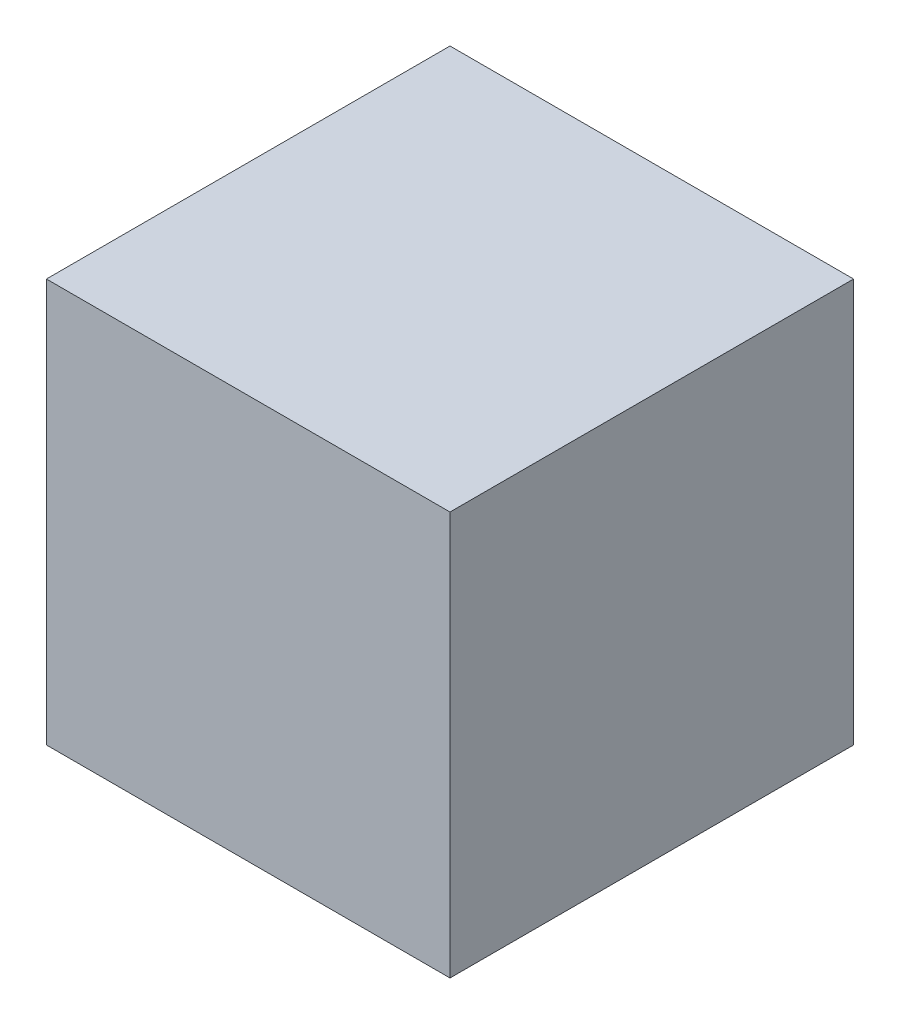
ISO-10303-21;
HEADER;
FILE_DESCRIPTION(('STEP AP214'),'2;1');
FILE_NAME('part.step','',(''),(''),'','','');
FILE_SCHEMA(('AUTOMOTIVE_DESIGN { 1 0 10303 214 1 1 1 1 }'));
ENDSEC;
DATA;
#1=APPLICATION_CONTEXT('core data for automotive mechanical design processes');
#2=APPLICATION_PROTOCOL_DEFINITION('international standard','automotive_design',2000,#1);
#3=PRODUCT_CONTEXT('',#1,'mechanical');
#4=PRODUCT('Part','Part','',(#3));
#5=PRODUCT_RELATED_PRODUCT_CATEGORY('part','',(#4));
#6=PRODUCT_DEFINITION_FORMATION('','',#4);
#7=PRODUCT_DEFINITION_CONTEXT('part definition',#1,'design');
#8=PRODUCT_DEFINITION('design','',#6,#7);
#9=PRODUCT_DEFINITION_SHAPE('','',#8);
#10=(LENGTH_UNIT() NAMED_UNIT(*) SI_UNIT(.MILLI.,.METRE.));
#11=(NAMED_UNIT(*) PLANE_ANGLE_UNIT() SI_UNIT($,.RADIAN.));
#12=(NAMED_UNIT(*) SI_UNIT($,.STERADIAN.) SOLID_ANGLE_UNIT());
#13=UNCERTAINTY_MEASURE_WITH_UNIT(LENGTH_MEASURE(1.E-05),#10,'distance_accuracy_value','');
#14=(GEOMETRIC_REPRESENTATION_CONTEXT(3) GLOBAL_UNCERTAINTY_ASSIGNED_CONTEXT((#13)) GLOBAL_UNIT_ASSIGNED_CONTEXT((#10,
#11,#12)) REPRESENTATION_CONTEXT('',''));
#15=CARTESIAN_POINT('',(0.,0.,0.));
#16=DIRECTION('',(0.,0.,1.));
#17=DIRECTION('',(1.,0.,0.));
#18=AXIS2_PLACEMENT_3D('',#15,#16,#17);
#19=CARTESIAN_POINT('',(17.5,-17.5,35.));
#20=DIRECTION('',(-1.,0.,0.));
#21=DIRECTION('',(0.,0.,1.));
#22=AXIS2_PLACEMENT_3D('',#19,#20,#21);
#23=PLANE('',#22);
#24=DIRECTION('',(0.,1.,0.));
#25=VECTOR('',#24,1.);
#26=CARTESIAN_POINT('',(17.5,-17.5,0.));
#27=LINE('',#26,#25);
#28=CARTESIAN_POINT('',(17.5,-17.5,0.));
#29=VERTEX_POINT('',#28);
#30=CARTESIAN_POINT('',(17.5,17.5,0.));
#31=VERTEX_POINT('',#30);
#32=EDGE_CURVE('E98',#29,#31,#27,.T.);
#33=ORIENTED_EDGE('',*,*,#32,.T.);
#34=DIRECTION('',(0.,0.,-1.));
#35=VECTOR('',#34,1.);
#36=CARTESIAN_POINT('',(17.5,17.5,35.));
#37=LINE('',#36,#35);
#38=CARTESIAN_POINT('',(17.5,17.5,35.));
#39=VERTEX_POINT('',#38);
#40=EDGE_CURVE('E11',#39,#31,#37,.T.);
#41=ORIENTED_EDGE('',*,*,#40,.F.);
#42=DIRECTION('',(0.,1.,0.));
#43=VECTOR('',#42,1.);
#44=CARTESIAN_POINT('',(17.5,-17.5,35.));
#45=LINE('',#44,#43);
#46=CARTESIAN_POINT('',(17.5,-17.5,35.));
#47=VERTEX_POINT('',#46);
#48=EDGE_CURVE('E86',#47,#39,#45,.T.);
#49=ORIENTED_EDGE('',*,*,#48,.F.);
#50=DIRECTION('',(0.,0.,-1.));
#51=VECTOR('',#50,1.);
#52=CARTESIAN_POINT('',(17.5,-17.5,35.));
#53=LINE('',#52,#51);
#54=EDGE_CURVE('E94',#47,#29,#53,.T.);
#55=ORIENTED_EDGE('',*,*,#54,.T.);
#56=EDGE_LOOP('',(#33,#41,#49,#55));
#57=FACE_BOUND('',#56,.T.);
#58=ADVANCED_FACE('F35',(#57),#23,.F.);
#59=CARTESIAN_POINT('',(-17.5,17.5,35.));
#60=DIRECTION('',(0.,-1.,0.));
#61=DIRECTION('',(0.,0.,-1.));
#62=AXIS2_PLACEMENT_3D('',#59,#60,#61);
#63=PLANE('',#62);
#64=DIRECTION('',(-1.,0.,0.));
#65=VECTOR('',#64,1.);
#66=CARTESIAN_POINT('',(-17.5,17.5,0.));
#67=LINE('',#66,#65);
#68=CARTESIAN_POINT('',(-17.5,17.5,0.));
#69=VERTEX_POINT('',#68);
#70=EDGE_CURVE('E90',#31,#69,#67,.T.);
#71=ORIENTED_EDGE('',*,*,#70,.T.);
#72=DIRECTION('',(0.,0.,-1.));
#73=VECTOR('',#72,1.);
#74=CARTESIAN_POINT('',(-17.5,17.5,35.));
#75=LINE('',#74,#73);
#76=CARTESIAN_POINT('',(-17.5,17.5,35.));
#77=VERTEX_POINT('',#76);
#78=EDGE_CURVE('E43',#77,#69,#75,.T.);
#79=ORIENTED_EDGE('',*,*,#78,.F.);
#80=DIRECTION('',(-1.,0.,0.));
#81=VECTOR('',#80,1.);
#82=CARTESIAN_POINT('',(-17.5,17.5,35.));
#83=LINE('',#82,#81);
#84=EDGE_CURVE('E81',#39,#77,#83,.T.);
#85=ORIENTED_EDGE('',*,*,#84,.F.);
#86=ORIENTED_EDGE('',*,*,#40,.T.);
#87=EDGE_LOOP('',(#71,#79,#85,#86));
#88=FACE_BOUND('',#87,.T.);
#89=ADVANCED_FACE('F89',(#88),#63,.F.);
#90=CARTESIAN_POINT('',(-17.5,-17.5,35.));
#91=DIRECTION('',(1.,0.,0.));
#92=DIRECTION('',(0.,0.,-1.));
#93=AXIS2_PLACEMENT_3D('',#90,#91,#92);
#94=PLANE('',#93);
#95=DIRECTION('',(0.,-1.,0.));
#96=VECTOR('',#95,1.);
#97=CARTESIAN_POINT('',(-17.5,-17.5,0.));
#98=LINE('',#97,#96);
#99=CARTESIAN_POINT('',(-17.5,-17.5,0.));
#100=VERTEX_POINT('',#99);
#101=EDGE_CURVE('E68',#69,#100,#98,.T.);
#102=ORIENTED_EDGE('',*,*,#101,.T.);
#103=DIRECTION('',(0.,0.,-1.));
#104=VECTOR('',#103,1.);
#105=CARTESIAN_POINT('',(-17.5,-17.5,35.));
#106=LINE('',#105,#104);
#107=CARTESIAN_POINT('',(-17.5,-17.5,35.));
#108=VERTEX_POINT('',#107);
#109=EDGE_CURVE('E91',#108,#100,#106,.T.);
#110=ORIENTED_EDGE('',*,*,#109,.F.);
#111=DIRECTION('',(0.,-1.,0.));
#112=VECTOR('',#111,1.);
#113=CARTESIAN_POINT('',(-17.5,-17.5,35.));
#114=LINE('',#113,#112);
#115=EDGE_CURVE('E84',#77,#108,#114,.T.);
#116=ORIENTED_EDGE('',*,*,#115,.F.);
#117=ORIENTED_EDGE('',*,*,#78,.T.);
#118=EDGE_LOOP('',(#102,#110,#116,#117));
#119=FACE_BOUND('',#118,.T.);
#120=ADVANCED_FACE('F92',(#119),#94,.F.);
#121=CARTESIAN_POINT('',(-17.5,-17.5,35.));
#122=DIRECTION('',(0.,1.,0.));
#123=DIRECTION('',(0.,0.,1.));
#124=AXIS2_PLACEMENT_3D('',#121,#122,#123);
#125=PLANE('',#124);
#126=DIRECTION('',(1.,0.,0.));
#127=VECTOR('',#126,1.);
#128=CARTESIAN_POINT('',(-17.5,-17.5,0.));
#129=LINE('',#128,#127);
#130=EDGE_CURVE('E74',#100,#29,#129,.T.);
#131=ORIENTED_EDGE('',*,*,#130,.T.);
#132=ORIENTED_EDGE('',*,*,#54,.F.);
#133=DIRECTION('',(1.,0.,0.));
#134=VECTOR('',#133,1.);
#135=CARTESIAN_POINT('',(-17.5,-17.5,35.));
#136=LINE('',#135,#134);
#137=EDGE_CURVE('E51',#108,#47,#136,.T.);
#138=ORIENTED_EDGE('',*,*,#137,.F.);
#139=ORIENTED_EDGE('',*,*,#109,.T.);
#140=EDGE_LOOP('',(#131,#132,#138,#139));
#141=FACE_BOUND('',#140,.T.);
#142=ADVANCED_FACE('F105',(#141),#125,.F.);
#143=CARTESIAN_POINT('',(0.,0.,35.));
#144=DIRECTION('',(0.,0.,-1.));
#145=DIRECTION('',(-1.,0.,0.));
#146=AXIS2_PLACEMENT_3D('',#143,#144,#145);
#147=PLANE('',#146);
#148=ORIENTED_EDGE('',*,*,#48,.T.);
#149=ORIENTED_EDGE('',*,*,#84,.T.);
#150=ORIENTED_EDGE('',*,*,#115,.T.);
#151=ORIENTED_EDGE('',*,*,#137,.T.);
#152=EDGE_LOOP('',(#148,#149,#150,#151));
#153=FACE_BOUND('',#152,.T.);
#154=ADVANCED_FACE('F82',(#153),#147,.F.);
#155=CARTESIAN_POINT('',(0.,0.,0.));
#156=DIRECTION('',(0.,0.,-1.));
#157=DIRECTION('',(-1.,0.,0.));
#158=AXIS2_PLACEMENT_3D('',#155,#156,#157);
#159=PLANE('',#158);
#160=ORIENTED_EDGE('',*,*,#32,.F.);
#161=ORIENTED_EDGE('',*,*,#130,.F.);
#162=ORIENTED_EDGE('',*,*,#101,.F.);
#163=ORIENTED_EDGE('',*,*,#70,.F.);
#164=EDGE_LOOP('',(#160,#161,#162,#163));
#165=FACE_BOUND('',#164,.T.);
#166=ADVANCED_FACE('F108',(#165),#159,.T.);
#167=CLOSED_SHELL('',(#58,#89,#120,#142,#154,#166));
#168=MANIFOLD_SOLID_BREP('B2',#167);
#169=ADVANCED_BREP_SHAPE_REPRESENTATION('',(#18,#168),#14);
#170=SHAPE_DEFINITION_REPRESENTATION(#9,#169);
ENDSEC;
END-ISO-10303-21;
